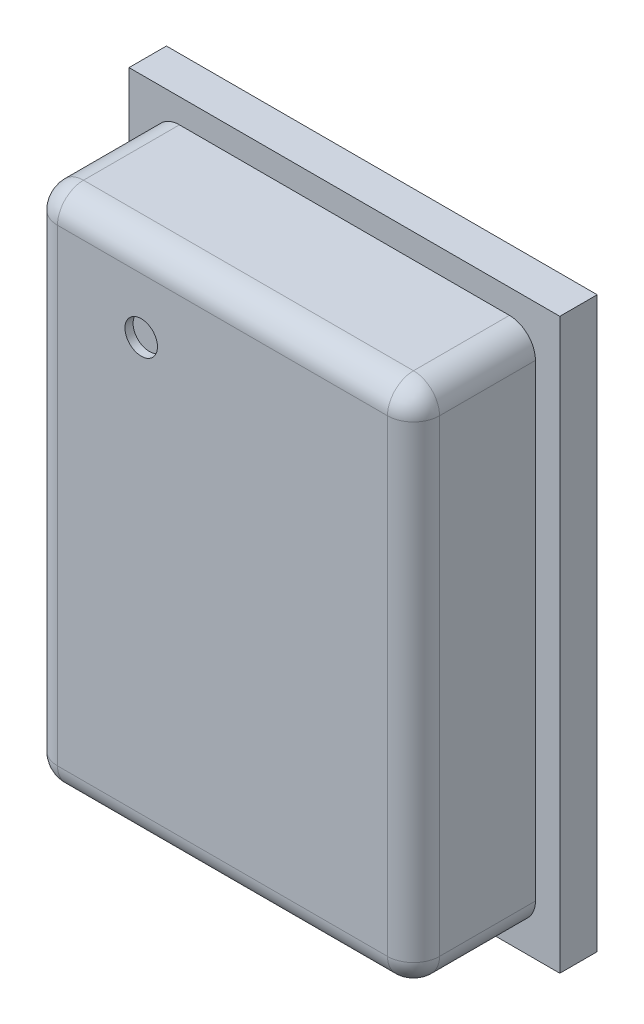
ISO-10303-21;
HEADER;
FILE_DESCRIPTION(('STEP AP214'),'2;1');
FILE_NAME('part.step','',(''),(''),'','','');
FILE_SCHEMA(('AUTOMOTIVE_DESIGN { 1 0 10303 214 1 1 1 1 }'));
ENDSEC;
DATA;
#1=APPLICATION_CONTEXT('core data for automotive mechanical design processes');
#2=APPLICATION_PROTOCOL_DEFINITION('international standard','automotive_design',2000,#1);
#3=PRODUCT_CONTEXT('',#1,'mechanical');
#4=PRODUCT('Part','Part','',(#3));
#5=PRODUCT_RELATED_PRODUCT_CATEGORY('part','',(#4));
#6=PRODUCT_DEFINITION_FORMATION('','',#4);
#7=PRODUCT_DEFINITION_CONTEXT('part definition',#1,'design');
#8=PRODUCT_DEFINITION('design','',#6,#7);
#9=PRODUCT_DEFINITION_SHAPE('','',#8);
#10=(LENGTH_UNIT() NAMED_UNIT(*) SI_UNIT(.MILLI.,.METRE.));
#11=(NAMED_UNIT(*) PLANE_ANGLE_UNIT() SI_UNIT($,.RADIAN.));
#12=(NAMED_UNIT(*) SI_UNIT($,.STERADIAN.) SOLID_ANGLE_UNIT());
#13=UNCERTAINTY_MEASURE_WITH_UNIT(LENGTH_MEASURE(1.E-05),#10,'distance_accuracy_value','');
#14=(GEOMETRIC_REPRESENTATION_CONTEXT(3) GLOBAL_UNCERTAINTY_ASSIGNED_CONTEXT((#13)) GLOBAL_UNIT_ASSIGNED_CONTEXT((#10,
#11,#12)) REPRESENTATION_CONTEXT('',''));
#15=CARTESIAN_POINT('',(0.,0.,0.));
#16=DIRECTION('',(0.,0.,1.));
#17=DIRECTION('',(1.,0.,0.));
#18=AXIS2_PLACEMENT_3D('',#15,#16,#17);
#19=CARTESIAN_POINT('',(0.,-0.71,0.23));
#20=DIRECTION('',(0.,0.,1.));
#21=DIRECTION('',(1.,0.,0.));
#22=AXIS2_PLACEMENT_3D('',#19,#20,#21);
#23=CYLINDRICAL_SURFACE('',#22,0.1625);
#24=CARTESIAN_POINT('',(0.,-0.71,0.));
#25=DIRECTION('',(0.,0.,1.));
#26=DIRECTION('',(1.,0.,0.));
#27=AXIS2_PLACEMENT_3D('',#24,#25,#26);
#28=CIRCLE('',#27,0.1625);
#29=CARTESIAN_POINT('',(0.1625,-0.71,0.));
#30=VERTEX_POINT('',#29);
#31=EDGE_CURVE('P0_E110',#30,#30,#28,.T.);
#32=ORIENTED_EDGE('',*,*,#31,.F.);
#33=EDGE_LOOP('',(#32));
#34=FACE_BOUND('',#33,.T.);
#35=CARTESIAN_POINT('',(0.,-0.71,0.23));
#36=DIRECTION('',(0.,0.,1.));
#37=DIRECTION('',(1.,0.,0.));
#38=AXIS2_PLACEMENT_3D('',#35,#36,#37);
#39=CIRCLE('',#38,0.1625);
#40=CARTESIAN_POINT('',(0.1625,-0.71,0.23));
#41=VERTEX_POINT('',#40);
#42=EDGE_CURVE('P0_E11',#41,#41,#39,.T.);
#43=ORIENTED_EDGE('',*,*,#42,.T.);
#44=EDGE_LOOP('',(#43));
#45=FACE_BOUND('',#44,.T.);
#46=ADVANCED_FACE('P0_F17',(#34,#45),#23,.F.);
#47=CARTESIAN_POINT('',(1.325,-1.75,0.));
#48=DIRECTION('',(0.,-1.,0.));
#49=DIRECTION('',(0.,0.,-1.));
#50=AXIS2_PLACEMENT_3D('',#47,#48,#49);
#51=PLANE('',#50);
#52=DIRECTION('',(0.,0.,1.));
#53=VECTOR('',#52,1.);
#54=CARTESIAN_POINT('',(1.325,-1.75,0.));
#55=LINE('',#54,#53);
#56=CARTESIAN_POINT('',(1.325,-1.75,0.));
#57=VERTEX_POINT('',#56);
#58=CARTESIAN_POINT('',(1.325,-1.75,0.23));
#59=VERTEX_POINT('',#58);
#60=EDGE_CURVE('P0_E117',#57,#59,#55,.T.);
#61=ORIENTED_EDGE('',*,*,#60,.T.);
#62=DIRECTION('',(-1.,0.,0.));
#63=VECTOR('',#62,1.);
#64=CARTESIAN_POINT('',(1.325,-1.75,0.23));
#65=LINE('',#64,#63);
#66=CARTESIAN_POINT('',(-1.325,-1.75,0.23));
#67=VERTEX_POINT('',#66);
#68=EDGE_CURVE('P0_E26',#59,#67,#65,.T.);
#69=ORIENTED_EDGE('',*,*,#68,.T.);
#70=DIRECTION('',(0.,0.,1.));
#71=VECTOR('',#70,1.);
#72=CARTESIAN_POINT('',(-1.325,-1.75,0.));
#73=LINE('',#72,#71);
#74=CARTESIAN_POINT('',(-1.325,-1.75,0.));
#75=VERTEX_POINT('',#74);
#76=EDGE_CURVE('P0_E94',#75,#67,#73,.T.);
#77=ORIENTED_EDGE('',*,*,#76,.F.);
#78=DIRECTION('',(-1.,0.,0.));
#79=VECTOR('',#78,1.);
#80=CARTESIAN_POINT('',(1.325,-1.75,0.));
#81=LINE('',#80,#79);
#82=EDGE_CURVE('P0_E38',#57,#75,#81,.T.);
#83=ORIENTED_EDGE('',*,*,#82,.F.);
#84=EDGE_LOOP('',(#61,#69,#77,#83));
#85=FACE_BOUND('',#84,.T.);
#86=ADVANCED_FACE('P0_F160',(#85),#51,.T.);
#87=CARTESIAN_POINT('',(0.,0.,0.23));
#88=DIRECTION('',(0.,0.,1.));
#89=DIRECTION('',(1.,0.,0.));
#90=AXIS2_PLACEMENT_3D('',#87,#88,#89);
#91=PLANE('',#90);
#92=ORIENTED_EDGE('',*,*,#42,.F.);
#93=EDGE_LOOP('',(#92));
#94=FACE_BOUND('',#93,.T.);
#95=DIRECTION('',(1.,0.,0.));
#96=VECTOR('',#95,1.);
#97=CARTESIAN_POINT('',(-1.325,1.75,0.23));
#98=LINE('',#97,#96);
#99=CARTESIAN_POINT('',(-1.325,1.75,0.23));
#100=VERTEX_POINT('',#99);
#101=CARTESIAN_POINT('',(1.325,1.75,0.23));
#102=VERTEX_POINT('',#101);
#103=EDGE_CURVE('P0_E99',#100,#102,#98,.T.);
#104=ORIENTED_EDGE('',*,*,#103,.F.);
#105=DIRECTION('',(0.,1.,0.));
#106=VECTOR('',#105,1.);
#107=CARTESIAN_POINT('',(-1.325,-1.75,0.23));
#108=LINE('',#107,#106);
#109=EDGE_CURVE('P0_E85',#67,#100,#108,.T.);
#110=ORIENTED_EDGE('',*,*,#109,.F.);
#111=ORIENTED_EDGE('',*,*,#68,.F.);
#112=DIRECTION('',(0.,-1.,0.));
#113=VECTOR('',#112,1.);
#114=CARTESIAN_POINT('',(1.325,1.75,0.23));
#115=LINE('',#114,#113);
#116=EDGE_CURVE('P0_E84',#102,#59,#115,.T.);
#117=ORIENTED_EDGE('',*,*,#116,.F.);
#118=EDGE_LOOP('',(#104,#110,#111,#117));
#119=FACE_BOUND('',#118,.T.);
#120=ADVANCED_FACE('P0_F155',(#94,#119),#91,.T.);
#121=CARTESIAN_POINT('',(0.,0.,0.));
#122=DIRECTION('',(0.,0.,1.));
#123=DIRECTION('',(1.,0.,0.));
#124=AXIS2_PLACEMENT_3D('',#121,#122,#123);
#125=PLANE('',#124);
#126=ORIENTED_EDGE('',*,*,#31,.T.);
#127=EDGE_LOOP('',(#126));
#128=FACE_BOUND('',#127,.T.);
#129=DIRECTION('',(0.,-1.,0.));
#130=VECTOR('',#129,1.);
#131=CARTESIAN_POINT('',(1.325,1.75,0.));
#132=LINE('',#131,#130);
#133=CARTESIAN_POINT('',(1.325,1.75,0.));
#134=VERTEX_POINT('',#133);
#135=EDGE_CURVE('P0_E62',#134,#57,#132,.T.);
#136=ORIENTED_EDGE('',*,*,#135,.T.);
#137=ORIENTED_EDGE('',*,*,#82,.T.);
#138=DIRECTION('',(0.,1.,0.));
#139=VECTOR('',#138,1.);
#140=CARTESIAN_POINT('',(-1.325,-1.75,0.));
#141=LINE('',#140,#139);
#142=CARTESIAN_POINT('',(-1.325,1.75,0.));
#143=VERTEX_POINT('',#142);
#144=EDGE_CURVE('P0_E75',#75,#143,#141,.T.);
#145=ORIENTED_EDGE('',*,*,#144,.T.);
#146=DIRECTION('',(1.,0.,0.));
#147=VECTOR('',#146,1.);
#148=CARTESIAN_POINT('',(-1.325,1.75,0.));
#149=LINE('',#148,#147);
#150=EDGE_CURVE('P0_E78',#143,#134,#149,.T.);
#151=ORIENTED_EDGE('',*,*,#150,.T.);
#152=EDGE_LOOP('',(#136,#137,#145,#151));
#153=FACE_BOUND('',#152,.T.);
#154=ADVANCED_FACE('P0_F77',(#128,#153),#125,.F.);
#155=CARTESIAN_POINT('',(1.325,1.75,0.));
#156=DIRECTION('',(1.,0.,0.));
#157=DIRECTION('',(0.,1.,0.));
#158=AXIS2_PLACEMENT_3D('',#155,#156,#157);
#159=PLANE('',#158);
#160=DIRECTION('',(0.,0.,1.));
#161=VECTOR('',#160,1.);
#162=CARTESIAN_POINT('',(1.325,1.75,0.));
#163=LINE('',#162,#161);
#164=EDGE_CURVE('P0_E92',#134,#102,#163,.T.);
#165=ORIENTED_EDGE('',*,*,#164,.T.);
#166=ORIENTED_EDGE('',*,*,#116,.T.);
#167=ORIENTED_EDGE('',*,*,#60,.F.);
#168=ORIENTED_EDGE('',*,*,#135,.F.);
#169=EDGE_LOOP('',(#165,#166,#167,#168));
#170=FACE_BOUND('',#169,.T.);
#171=ADVANCED_FACE('P0_F143',(#170),#159,.T.);
#172=CARTESIAN_POINT('',(-1.325,-1.75,0.));
#173=DIRECTION('',(-1.,0.,0.));
#174=DIRECTION('',(0.,0.,1.));
#175=AXIS2_PLACEMENT_3D('',#172,#173,#174);
#176=PLANE('',#175);
#177=ORIENTED_EDGE('',*,*,#76,.T.);
#178=ORIENTED_EDGE('',*,*,#109,.T.);
#179=DIRECTION('',(0.,0.,1.));
#180=VECTOR('',#179,1.);
#181=CARTESIAN_POINT('',(-1.325,1.75,0.));
#182=LINE('',#181,#180);
#183=EDGE_CURVE('P0_E91',#143,#100,#182,.T.);
#184=ORIENTED_EDGE('',*,*,#183,.F.);
#185=ORIENTED_EDGE('',*,*,#144,.F.);
#186=EDGE_LOOP('',(#177,#178,#184,#185));
#187=FACE_BOUND('',#186,.T.);
#188=ADVANCED_FACE('P0_F96',(#187),#176,.T.);
#189=CARTESIAN_POINT('',(-1.325,1.75,0.));
#190=DIRECTION('',(0.,1.,0.));
#191=DIRECTION('',(1.,0.,0.));
#192=AXIS2_PLACEMENT_3D('',#189,#190,#191);
#193=PLANE('',#192);
#194=ORIENTED_EDGE('',*,*,#183,.T.);
#195=ORIENTED_EDGE('',*,*,#103,.T.);
#196=ORIENTED_EDGE('',*,*,#164,.F.);
#197=ORIENTED_EDGE('',*,*,#150,.F.);
#198=EDGE_LOOP('',(#194,#195,#196,#197));
#199=FACE_BOUND('',#198,.T.);
#200=ADVANCED_FACE('P0_F89',(#199),#193,.T.);
#201=CLOSED_SHELL('',(#46,#86,#120,#154,#171,#188,#200));
#202=MANIFOLD_SOLID_BREP('P0_B1',#201);
#203=CARTESIAN_POINT('',(-0.5,1.1,0.93));
#204=DIRECTION('',(0.,0.,1.));
#205=DIRECTION('',(1.,0.,0.));
#206=AXIS2_PLACEMENT_3D('',#203,#204,#205);
#207=PLANE('',#206);
#208=CARTESIAN_POINT('',(-0.5,1.1,0.93));
#209=DIRECTION('',(0.,0.,1.));
#210=DIRECTION('',(1.,0.,0.));
#211=AXIS2_PLACEMENT_3D('',#208,#209,#210);
#212=CIRCLE('',#211,0.1);
#213=CARTESIAN_POINT('',(-0.4,1.1,0.93));
#214=VERTEX_POINT('',#213);
#215=EDGE_CURVE('P1_E11',#214,#214,#212,.T.);
#216=ORIENTED_EDGE('',*,*,#215,.T.);
#217=EDGE_LOOP('',(#216));
#218=FACE_BOUND('',#217,.T.);
#219=ADVANCED_FACE('P1_F17',(#218),#207,.T.);
#220=CARTESIAN_POINT('',(-0.5,1.1,0.98));
#221=DIRECTION('',(0.,0.,1.));
#222=DIRECTION('',(1.,0.,0.));
#223=AXIS2_PLACEMENT_3D('',#220,#221,#222);
#224=CYLINDRICAL_SURFACE('',#223,0.1);
#225=ORIENTED_EDGE('',*,*,#215,.F.);
#226=EDGE_LOOP('',(#225));
#227=FACE_BOUND('',#226,.T.);
#228=CARTESIAN_POINT('',(-0.5,1.1,0.98));
#229=DIRECTION('',(0.,0.,1.));
#230=DIRECTION('',(1.,0.,0.));
#231=AXIS2_PLACEMENT_3D('',#228,#229,#230);
#232=CIRCLE('',#231,0.1);
#233=CARTESIAN_POINT('',(-0.4,1.1,0.98));
#234=VERTEX_POINT('',#233);
#235=EDGE_CURVE('P1_E250',#234,#234,#232,.T.);
#236=ORIENTED_EDGE('',*,*,#235,.T.);
#237=EDGE_LOOP('',(#236));
#238=FACE_BOUND('',#237,.T.);
#239=ADVANCED_FACE('P1_F350',(#227,#238),#224,.F.);
#240=CARTESIAN_POINT('',(1.175,-1.44,0.82));
#241=DIRECTION('',(-1.,0.,0.));
#242=DIRECTION('',(0.,-1.,0.));
#243=AXIS2_PLACEMENT_3D('',#240,#241,#242);
#244=CYLINDRICAL_SURFACE('',#243,0.16);
#245=CARTESIAN_POINT('',(1.015,-1.44,0.82));
#246=DIRECTION('',(-1.,0.,0.));
#247=DIRECTION('',(0.,0.,1.));
#248=AXIS2_PLACEMENT_3D('',#245,#246,#247);
#249=CIRCLE('',#248,0.16);
#250=CARTESIAN_POINT('',(1.015,-1.6,0.82));
#251=VERTEX_POINT('',#250);
#252=CARTESIAN_POINT('',(1.015,-1.44,0.98));
#253=VERTEX_POINT('',#252);
#254=EDGE_CURVE('P1_E25',#251,#253,#249,.T.);
#255=ORIENTED_EDGE('',*,*,#254,.T.);
#256=DIRECTION('',(-1.,0.,0.));
#257=VECTOR('',#256,1.);
#258=CARTESIAN_POINT('',(1.175,-1.44,0.98));
#259=LINE('',#258,#257);
#260=CARTESIAN_POINT('',(-1.015,-1.44,0.98));
#261=VERTEX_POINT('',#260);
#262=EDGE_CURVE('P1_E243',#253,#261,#259,.T.);
#263=ORIENTED_EDGE('',*,*,#262,.T.);
#264=CARTESIAN_POINT('',(-1.015,-1.44,0.82));
#265=DIRECTION('',(-1.,0.,0.));
#266=DIRECTION('',(0.,0.,1.));
#267=AXIS2_PLACEMENT_3D('',#264,#265,#266);
#268=CIRCLE('',#267,0.16);
#269=CARTESIAN_POINT('',(-1.015,-1.6,0.82));
#270=VERTEX_POINT('',#269);
#271=EDGE_CURVE('P1_E46',#270,#261,#268,.T.);
#272=ORIENTED_EDGE('',*,*,#271,.F.);
#273=DIRECTION('',(-1.,0.,0.));
#274=VECTOR('',#273,1.);
#275=CARTESIAN_POINT('',(1.175,-1.6,0.82));
#276=LINE('',#275,#274);
#277=EDGE_CURVE('P1_E133',#251,#270,#276,.T.);
#278=ORIENTED_EDGE('',*,*,#277,.F.);
#279=EDGE_LOOP('',(#255,#263,#272,#278));
#280=FACE_BOUND('',#279,.T.);
#281=ADVANCED_FACE('P1_F344',(#280),#244,.T.);
#282=CARTESIAN_POINT('',(1.015,-1.44,0.82));
#283=DIRECTION('',(0.,1.,0.));
#284=DIRECTION('',(0.,0.,1.));
#285=AXIS2_PLACEMENT_3D('',#282,#283,#284);
#286=SPHERICAL_SURFACE('',#285,0.16);
#287=ORIENTED_EDGE('',*,*,#254,.F.);
#288=CARTESIAN_POINT('',(1.015,-1.44,0.82));
#289=DIRECTION('',(0.,0.,1.));
#290=DIRECTION('',(1.,0.,0.));
#291=AXIS2_PLACEMENT_3D('',#288,#289,#290);
#292=CIRCLE('',#291,0.16);
#293=CARTESIAN_POINT('',(1.175,-1.44,0.82));
#294=VERTEX_POINT('',#293);
#295=EDGE_CURVE('P1_E129',#251,#294,#292,.T.);
#296=ORIENTED_EDGE('',*,*,#295,.T.);
#297=CARTESIAN_POINT('',(1.015,-1.44,0.82));
#298=DIRECTION('',(0.,1.,0.));
#299=DIRECTION('',(0.,0.,1.));
#300=AXIS2_PLACEMENT_3D('',#297,#298,#299);
#301=CIRCLE('',#300,0.16);
#302=EDGE_CURVE('P1_E257',#253,#294,#301,.T.);
#303=ORIENTED_EDGE('',*,*,#302,.F.);
#304=EDGE_LOOP('',(#287,#296,#303));
#305=FACE_BOUND('',#304,.T.);
#306=ADVANCED_FACE('P1_F349',(#305),#286,.T.);
#307=CARTESIAN_POINT('',(-1.015,-1.44,0.82));
#308=DIRECTION('',(0.,1.,0.));
#309=DIRECTION('',(-1.,0.,0.));
#310=AXIS2_PLACEMENT_3D('',#307,#308,#309);
#311=SPHERICAL_SURFACE('',#310,0.16);
#312=CARTESIAN_POINT('',(-1.015,-1.44,0.82));
#313=DIRECTION('',(0.,0.,-1.));
#314=DIRECTION('',(-1.,0.,0.));
#315=AXIS2_PLACEMENT_3D('',#312,#313,#314);
#316=CIRCLE('',#315,0.16);
#317=CARTESIAN_POINT('',(-1.175,-1.44,0.82));
#318=VERTEX_POINT('',#317);
#319=EDGE_CURVE('P1_E226',#270,#318,#316,.T.);
#320=ORIENTED_EDGE('',*,*,#319,.F.);
#321=ORIENTED_EDGE('',*,*,#271,.T.);
#322=CARTESIAN_POINT('',(-1.015,-1.44,0.82));
#323=DIRECTION('',(0.,1.,0.));
#324=DIRECTION('',(-1.,0.,0.));
#325=AXIS2_PLACEMENT_3D('',#322,#323,#324);
#326=CIRCLE('',#325,0.16);
#327=EDGE_CURVE('P1_E254',#318,#261,#326,.T.);
#328=ORIENTED_EDGE('',*,*,#327,.F.);
#329=EDGE_LOOP('',(#320,#321,#328));
#330=FACE_BOUND('',#329,.T.);
#331=ADVANCED_FACE('P1_F406',(#330),#311,.T.);
#332=CARTESIAN_POINT('',(1.015,1.6,0.82));
#333=DIRECTION('',(0.,-1.,0.));
#334=DIRECTION('',(1.,0.,0.));
#335=AXIS2_PLACEMENT_3D('',#332,#333,#334);
#336=CYLINDRICAL_SURFACE('',#335,0.16);
#337=DIRECTION('',(0.,-1.,0.));
#338=VECTOR('',#337,1.);
#339=CARTESIAN_POINT('',(1.175,1.6,0.82));
#340=LINE('',#339,#338);
#341=CARTESIAN_POINT('',(1.175,1.44,0.82));
#342=VERTEX_POINT('',#341);
#343=EDGE_CURVE('P1_E162',#342,#294,#340,.T.);
#344=ORIENTED_EDGE('',*,*,#343,.F.);
#345=CARTESIAN_POINT('',(1.015,1.44,0.82));
#346=DIRECTION('',(0.,1.,0.));
#347=DIRECTION('',(0.,0.,1.));
#348=AXIS2_PLACEMENT_3D('',#345,#346,#347);
#349=CIRCLE('',#348,0.16);
#350=CARTESIAN_POINT('',(1.015,1.44,0.98));
#351=VERTEX_POINT('',#350);
#352=EDGE_CURVE('P1_E237',#351,#342,#349,.T.);
#353=ORIENTED_EDGE('',*,*,#352,.F.);
#354=DIRECTION('',(0.,-1.,0.));
#355=VECTOR('',#354,1.);
#356=CARTESIAN_POINT('',(1.015,1.6,0.98));
#357=LINE('',#356,#355);
#358=EDGE_CURVE('P1_E246',#351,#253,#357,.T.);
#359=ORIENTED_EDGE('',*,*,#358,.T.);
#360=ORIENTED_EDGE('',*,*,#302,.T.);
#361=EDGE_LOOP('',(#344,#353,#359,#360));
#362=FACE_BOUND('',#361,.T.);
#363=ADVANCED_FACE('P1_F359',(#362),#336,.T.);
#364=CARTESIAN_POINT('',(-1.015,-1.6,0.82));
#365=DIRECTION('',(0.,1.,0.));
#366=DIRECTION('',(-1.,0.,0.));
#367=AXIS2_PLACEMENT_3D('',#364,#365,#366);
#368=CYLINDRICAL_SURFACE('',#367,0.16);
#369=DIRECTION('',(0.,1.,0.));
#370=VECTOR('',#369,1.);
#371=CARTESIAN_POINT('',(-1.175,-1.6,0.82));
#372=LINE('',#371,#370);
#373=CARTESIAN_POINT('',(-1.175,1.44,0.82));
#374=VERTEX_POINT('',#373);
#375=EDGE_CURVE('P1_E166',#318,#374,#372,.T.);
#376=ORIENTED_EDGE('',*,*,#375,.F.);
#377=ORIENTED_EDGE('',*,*,#327,.T.);
#378=DIRECTION('',(0.,1.,0.));
#379=VECTOR('',#378,1.);
#380=CARTESIAN_POINT('',(-1.015,-1.6,0.98));
#381=LINE('',#380,#379);
#382=CARTESIAN_POINT('',(-1.015,1.44,0.98));
#383=VERTEX_POINT('',#382);
#384=EDGE_CURVE('P1_E240',#261,#383,#381,.T.);
#385=ORIENTED_EDGE('',*,*,#384,.T.);
#386=CARTESIAN_POINT('',(-1.015,1.44,0.82));
#387=DIRECTION('',(0.,-1.,0.));
#388=DIRECTION('',(-1.,0.,0.));
#389=AXIS2_PLACEMENT_3D('',#386,#387,#388);
#390=CIRCLE('',#389,0.16);
#391=EDGE_CURVE('P1_E234',#383,#374,#390,.T.);
#392=ORIENTED_EDGE('',*,*,#391,.T.);
#393=EDGE_LOOP('',(#376,#377,#385,#392));
#394=FACE_BOUND('',#393,.T.);
#395=ADVANCED_FACE('P1_F304',(#394),#368,.T.);
#396=CARTESIAN_POINT('',(0.,0.,0.98));
#397=DIRECTION('',(0.,0.,1.));
#398=DIRECTION('',(1.,0.,0.));
#399=AXIS2_PLACEMENT_3D('',#396,#397,#398);
#400=PLANE('',#399);
#401=ORIENTED_EDGE('',*,*,#235,.F.);
#402=EDGE_LOOP('',(#401));
#403=FACE_BOUND('',#402,.T.);
#404=ORIENTED_EDGE('',*,*,#384,.F.);
#405=ORIENTED_EDGE('',*,*,#262,.F.);
#406=ORIENTED_EDGE('',*,*,#358,.F.);
#407=DIRECTION('',(1.,0.,0.));
#408=VECTOR('',#407,1.);
#409=CARTESIAN_POINT('',(-1.175,1.44,0.98));
#410=LINE('',#409,#408);
#411=EDGE_CURVE('P1_E212',#383,#351,#410,.T.);
#412=ORIENTED_EDGE('',*,*,#411,.F.);
#413=EDGE_LOOP('',(#404,#405,#406,#412));
#414=FACE_BOUND('',#413,.T.);
#415=ADVANCED_FACE('P1_F299',(#403,#414),#400,.T.);
#416=CARTESIAN_POINT('',(1.015,1.44,0.82));
#417=DIRECTION('',(0.,-1.,0.));
#418=DIRECTION('',(0.,0.,1.));
#419=AXIS2_PLACEMENT_3D('',#416,#417,#418);
#420=SPHERICAL_SURFACE('',#419,0.16);
#421=ORIENTED_EDGE('',*,*,#352,.T.);
#422=CARTESIAN_POINT('',(1.015,1.44,0.82));
#423=DIRECTION('',(0.,0.,-1.));
#424=DIRECTION('',(1.,0.,0.));
#425=AXIS2_PLACEMENT_3D('',#422,#423,#424);
#426=CIRCLE('',#425,0.16);
#427=CARTESIAN_POINT('',(1.015,1.6,0.82));
#428=VERTEX_POINT('',#427);
#429=EDGE_CURVE('P1_E180',#428,#342,#426,.T.);
#430=ORIENTED_EDGE('',*,*,#429,.F.);
#431=CARTESIAN_POINT('',(1.015,1.44,0.82));
#432=DIRECTION('',(1.,0.,0.));
#433=DIRECTION('',(0.,0.,1.));
#434=AXIS2_PLACEMENT_3D('',#431,#432,#433);
#435=CIRCLE('',#434,0.16);
#436=EDGE_CURVE('P1_E209',#428,#351,#435,.T.);
#437=ORIENTED_EDGE('',*,*,#436,.T.);
#438=EDGE_LOOP('',(#421,#430,#437));
#439=FACE_BOUND('',#438,.T.);
#440=ADVANCED_FACE('P1_F284',(#439),#420,.T.);
#441=CARTESIAN_POINT('',(-1.015,1.44,0.82));
#442=DIRECTION('',(0.,0.,-1.));
#443=DIRECTION('',(-1.,0.,0.));
#444=AXIS2_PLACEMENT_3D('',#441,#442,#443);
#445=SPHERICAL_SURFACE('',#444,0.16);
#446=ORIENTED_EDGE('',*,*,#391,.F.);
#447=CARTESIAN_POINT('',(-1.015,1.44,0.82));
#448=DIRECTION('',(-1.,0.,0.));
#449=DIRECTION('',(0.,1.,0.));
#450=AXIS2_PLACEMENT_3D('',#447,#448,#449);
#451=CIRCLE('',#450,0.16);
#452=CARTESIAN_POINT('',(-1.015,1.6,0.82));
#453=VERTEX_POINT('',#452);
#454=EDGE_CURVE('P1_E190',#383,#453,#451,.T.);
#455=ORIENTED_EDGE('',*,*,#454,.T.);
#456=CARTESIAN_POINT('',(-1.015,1.44,0.82));
#457=DIRECTION('',(0.,0.,-1.));
#458=DIRECTION('',(-1.,0.,0.));
#459=AXIS2_PLACEMENT_3D('',#456,#457,#458);
#460=CIRCLE('',#459,0.16);
#461=EDGE_CURVE('P1_E185',#374,#453,#460,.T.);
#462=ORIENTED_EDGE('',*,*,#461,.F.);
#463=EDGE_LOOP('',(#446,#455,#462));
#464=FACE_BOUND('',#463,.T.);
#465=ADVANCED_FACE('P1_F279',(#464),#445,.T.);
#466=CARTESIAN_POINT('',(1.175,-1.6,0.23));
#467=DIRECTION('',(0.,-1.,0.));
#468=DIRECTION('',(0.,0.,-1.));
#469=AXIS2_PLACEMENT_3D('',#466,#467,#468);
#470=PLANE('',#469);
#471=DIRECTION('',(-1.,0.,0.));
#472=VECTOR('',#471,1.);
#473=CARTESIAN_POINT('',(1.175,-1.6,0.23));
#474=LINE('',#473,#472);
#475=CARTESIAN_POINT('',(1.015,-1.6,0.23));
#476=VERTEX_POINT('',#475);
#477=CARTESIAN_POINT('',(-1.015,-1.6,0.23));
#478=VERTEX_POINT('',#477);
#479=EDGE_CURVE('P1_E136',#476,#478,#474,.T.);
#480=ORIENTED_EDGE('',*,*,#479,.F.);
#481=DIRECTION('',(0.,0.,1.));
#482=VECTOR('',#481,1.);
#483=CARTESIAN_POINT('',(1.015,-1.6,0.23));
#484=LINE('',#483,#482);
#485=EDGE_CURVE('P1_E121',#476,#251,#484,.T.);
#486=ORIENTED_EDGE('',*,*,#485,.T.);
#487=ORIENTED_EDGE('',*,*,#277,.T.);
#488=DIRECTION('',(0.,0.,1.));
#489=VECTOR('',#488,1.);
#490=CARTESIAN_POINT('',(-1.015,-1.6,0.23));
#491=LINE('',#490,#489);
#492=EDGE_CURVE('P1_E139',#478,#270,#491,.T.);
#493=ORIENTED_EDGE('',*,*,#492,.F.);
#494=EDGE_LOOP('',(#480,#486,#487,#493));
#495=FACE_BOUND('',#494,.T.);
#496=ADVANCED_FACE('P1_F137',(#495),#470,.T.);
#497=CARTESIAN_POINT('',(1.015,-1.44,0.23));
#498=DIRECTION('',(0.,0.,1.));
#499=DIRECTION('',(1.,0.,0.));
#500=AXIS2_PLACEMENT_3D('',#497,#498,#499);
#501=CYLINDRICAL_SURFACE('',#500,0.16);
#502=DIRECTION('',(0.,0.,1.));
#503=VECTOR('',#502,1.);
#504=CARTESIAN_POINT('',(1.175,-1.44,0.23));
#505=LINE('',#504,#503);
#506=CARTESIAN_POINT('',(1.175,-1.44,0.23));
#507=VERTEX_POINT('',#506);
#508=EDGE_CURVE('P1_E165',#507,#294,#505,.T.);
#509=ORIENTED_EDGE('',*,*,#508,.T.);
#510=ORIENTED_EDGE('',*,*,#295,.F.);
#511=ORIENTED_EDGE('',*,*,#485,.F.);
#512=CARTESIAN_POINT('',(1.015,-1.44,0.23));
#513=DIRECTION('',(0.,0.,-1.));
#514=DIRECTION('',(0.,-1.,0.));
#515=AXIS2_PLACEMENT_3D('',#512,#513,#514);
#516=CIRCLE('',#515,0.16);
#517=EDGE_CURVE('P1_E126',#507,#476,#516,.T.);
#518=ORIENTED_EDGE('',*,*,#517,.F.);
#519=EDGE_LOOP('',(#509,#510,#511,#518));
#520=FACE_BOUND('',#519,.T.);
#521=ADVANCED_FACE('P1_F124',(#520),#501,.T.);
#522=CARTESIAN_POINT('',(-1.015,-1.44,0.23));
#523=DIRECTION('',(0.,0.,1.));
#524=DIRECTION('',(0.,-1.,0.));
#525=AXIS2_PLACEMENT_3D('',#522,#523,#524);
#526=CYLINDRICAL_SURFACE('',#525,0.16);
#527=ORIENTED_EDGE('',*,*,#492,.T.);
#528=ORIENTED_EDGE('',*,*,#319,.T.);
#529=DIRECTION('',(0.,0.,1.));
#530=VECTOR('',#529,1.);
#531=CARTESIAN_POINT('',(-1.175,-1.44,0.23));
#532=LINE('',#531,#530);
#533=CARTESIAN_POINT('',(-1.175,-1.44,0.23));
#534=VERTEX_POINT('',#533);
#535=EDGE_CURVE('P1_E205',#534,#318,#532,.T.);
#536=ORIENTED_EDGE('',*,*,#535,.F.);
#537=CARTESIAN_POINT('',(-1.015,-1.44,0.23));
#538=DIRECTION('',(0.,0.,-1.));
#539=DIRECTION('',(0.,-1.,0.));
#540=AXIS2_PLACEMENT_3D('',#537,#538,#539);
#541=CIRCLE('',#540,0.16);
#542=EDGE_CURVE('P1_E144',#478,#534,#541,.T.);
#543=ORIENTED_EDGE('',*,*,#542,.F.);
#544=EDGE_LOOP('',(#527,#528,#536,#543));
#545=FACE_BOUND('',#544,.T.);
#546=ADVANCED_FACE('P1_F384',(#545),#526,.T.);
#547=CARTESIAN_POINT('',(1.175,1.6,0.23));
#548=DIRECTION('',(1.,0.,0.));
#549=DIRECTION('',(0.,1.,0.));
#550=AXIS2_PLACEMENT_3D('',#547,#548,#549);
#551=PLANE('',#550);
#552=DIRECTION('',(0.,-1.,0.));
#553=VECTOR('',#552,1.);
#554=CARTESIAN_POINT('',(1.175,1.6,0.23));
#555=LINE('',#554,#553);
#556=CARTESIAN_POINT('',(1.175,1.44,0.23));
#557=VERTEX_POINT('',#556);
#558=EDGE_CURVE('P1_E149',#557,#507,#555,.T.);
#559=ORIENTED_EDGE('',*,*,#558,.F.);
#560=DIRECTION('',(0.,0.,1.));
#561=VECTOR('',#560,1.);
#562=CARTESIAN_POINT('',(1.175,1.44,0.23));
#563=LINE('',#562,#561);
#564=EDGE_CURVE('P1_E184',#557,#342,#563,.T.);
#565=ORIENTED_EDGE('',*,*,#564,.T.);
#566=ORIENTED_EDGE('',*,*,#343,.T.);
#567=ORIENTED_EDGE('',*,*,#508,.F.);
#568=EDGE_LOOP('',(#559,#565,#566,#567));
#569=FACE_BOUND('',#568,.T.);
#570=ADVANCED_FACE('P1_F368',(#569),#551,.T.);
#571=CARTESIAN_POINT('',(-1.175,-1.6,0.23));
#572=DIRECTION('',(-1.,0.,0.));
#573=DIRECTION('',(0.,0.,1.));
#574=AXIS2_PLACEMENT_3D('',#571,#572,#573);
#575=PLANE('',#574);
#576=DIRECTION('',(0.,1.,0.));
#577=VECTOR('',#576,1.);
#578=CARTESIAN_POINT('',(-1.175,-1.6,0.23));
#579=LINE('',#578,#577);
#580=CARTESIAN_POINT('',(-1.175,1.44,0.23));
#581=VERTEX_POINT('',#580);
#582=EDGE_CURVE('P1_E194',#534,#581,#579,.T.);
#583=ORIENTED_EDGE('',*,*,#582,.F.);
#584=ORIENTED_EDGE('',*,*,#535,.T.);
#585=ORIENTED_EDGE('',*,*,#375,.T.);
#586=DIRECTION('',(0.,0.,1.));
#587=VECTOR('',#586,1.);
#588=CARTESIAN_POINT('',(-1.175,1.44,0.23));
#589=LINE('',#588,#587);
#590=EDGE_CURVE('P1_E198',#581,#374,#589,.T.);
#591=ORIENTED_EDGE('',*,*,#590,.F.);
#592=EDGE_LOOP('',(#583,#584,#585,#591));
#593=FACE_BOUND('',#592,.T.);
#594=ADVANCED_FACE('P1_F338',(#593),#575,.T.);
#595=CARTESIAN_POINT('',(-1.175,1.44,0.82));
#596=DIRECTION('',(1.,0.,0.));
#597=DIRECTION('',(0.,1.,0.));
#598=AXIS2_PLACEMENT_3D('',#595,#596,#597);
#599=CYLINDRICAL_SURFACE('',#598,0.16);
#600=ORIENTED_EDGE('',*,*,#454,.F.);
#601=ORIENTED_EDGE('',*,*,#411,.T.);
#602=ORIENTED_EDGE('',*,*,#436,.F.);
#603=DIRECTION('',(1.,0.,0.));
#604=VECTOR('',#603,1.);
#605=CARTESIAN_POINT('',(-1.175,1.6,0.82));
#606=LINE('',#605,#604);
#607=EDGE_CURVE('P1_E171',#453,#428,#606,.T.);
#608=ORIENTED_EDGE('',*,*,#607,.F.);
#609=EDGE_LOOP('',(#600,#601,#602,#608));
#610=FACE_BOUND('',#609,.T.);
#611=ADVANCED_FACE('P1_F329',(#610),#599,.T.);
#612=CARTESIAN_POINT('',(1.015,1.44,0.23));
#613=DIRECTION('',(0.,0.,1.));
#614=DIRECTION('',(0.,1.,0.));
#615=AXIS2_PLACEMENT_3D('',#612,#613,#614);
#616=CYLINDRICAL_SURFACE('',#615,0.16);
#617=DIRECTION('',(0.,0.,1.));
#618=VECTOR('',#617,1.);
#619=CARTESIAN_POINT('',(1.015,1.6,0.23));
#620=LINE('',#619,#618);
#621=CARTESIAN_POINT('',(1.015,1.6,0.23));
#622=VERTEX_POINT('',#621);
#623=EDGE_CURVE('P1_E176',#622,#428,#620,.T.);
#624=ORIENTED_EDGE('',*,*,#623,.T.);
#625=ORIENTED_EDGE('',*,*,#429,.T.);
#626=ORIENTED_EDGE('',*,*,#564,.F.);
#627=CARTESIAN_POINT('',(1.015,1.44,0.23));
#628=DIRECTION('',(0.,0.,-1.));
#629=DIRECTION('',(0.,-1.,0.));
#630=AXIS2_PLACEMENT_3D('',#627,#628,#629);
#631=CIRCLE('',#630,0.16);
#632=EDGE_CURVE('P1_E156',#622,#557,#631,.T.);
#633=ORIENTED_EDGE('',*,*,#632,.F.);
#634=EDGE_LOOP('',(#624,#625,#626,#633));
#635=FACE_BOUND('',#634,.T.);
#636=ADVANCED_FACE('P1_F320',(#635),#616,.T.);
#637=CARTESIAN_POINT('',(-1.015,1.44,0.23));
#638=DIRECTION('',(0.,0.,1.));
#639=DIRECTION('',(0.,1.,0.));
#640=AXIS2_PLACEMENT_3D('',#637,#638,#639);
#641=CYLINDRICAL_SURFACE('',#640,0.16);
#642=CARTESIAN_POINT('',(-1.015,1.44,0.23));
#643=DIRECTION('',(0.,0.,1.));
#644=DIRECTION('',(0.,-1.,0.));
#645=AXIS2_PLACEMENT_3D('',#642,#643,#644);
#646=CIRCLE('',#645,0.16);
#647=CARTESIAN_POINT('',(-1.015,1.6,0.23));
#648=VERTEX_POINT('',#647);
#649=EDGE_CURVE('P1_E160',#648,#581,#646,.T.);
#650=ORIENTED_EDGE('',*,*,#649,.T.);
#651=ORIENTED_EDGE('',*,*,#590,.T.);
#652=ORIENTED_EDGE('',*,*,#461,.T.);
#653=DIRECTION('',(0.,0.,1.));
#654=VECTOR('',#653,1.);
#655=CARTESIAN_POINT('',(-1.015,1.6,0.23));
#656=LINE('',#655,#654);
#657=EDGE_CURVE('P1_E167',#648,#453,#656,.T.);
#658=ORIENTED_EDGE('',*,*,#657,.F.);
#659=EDGE_LOOP('',(#650,#651,#652,#658));
#660=FACE_BOUND('',#659,.T.);
#661=ADVANCED_FACE('P1_F294',(#660),#641,.T.);
#662=CARTESIAN_POINT('',(0.,0.,0.23));
#663=DIRECTION('',(0.,0.,1.));
#664=DIRECTION('',(1.,0.,0.));
#665=AXIS2_PLACEMENT_3D('',#662,#663,#664);
#666=PLANE('',#665);
#667=ORIENTED_EDGE('',*,*,#632,.T.);
#668=ORIENTED_EDGE('',*,*,#558,.T.);
#669=ORIENTED_EDGE('',*,*,#517,.T.);
#670=ORIENTED_EDGE('',*,*,#479,.T.);
#671=ORIENTED_EDGE('',*,*,#542,.T.);
#672=ORIENTED_EDGE('',*,*,#582,.T.);
#673=ORIENTED_EDGE('',*,*,#649,.F.);
#674=DIRECTION('',(1.,0.,0.));
#675=VECTOR('',#674,1.);
#676=CARTESIAN_POINT('',(-1.175,1.6,0.23));
#677=LINE('',#676,#675);
#678=EDGE_CURVE('P1_E172',#648,#622,#677,.T.);
#679=ORIENTED_EDGE('',*,*,#678,.T.);
#680=EDGE_LOOP('',(#667,#668,#669,#670,#671,#672,#673,#679));
#681=FACE_BOUND('',#680,.T.);
#682=ADVANCED_FACE('P1_F147',(#681),#666,.F.);
#683=CARTESIAN_POINT('',(-1.175,1.6,0.23));
#684=DIRECTION('',(0.,1.,0.));
#685=DIRECTION('',(1.,0.,0.));
#686=AXIS2_PLACEMENT_3D('',#683,#684,#685);
#687=PLANE('',#686);
#688=ORIENTED_EDGE('',*,*,#678,.F.);
#689=ORIENTED_EDGE('',*,*,#657,.T.);
#690=ORIENTED_EDGE('',*,*,#607,.T.);
#691=ORIENTED_EDGE('',*,*,#623,.F.);
#692=EDGE_LOOP('',(#688,#689,#690,#691));
#693=FACE_BOUND('',#692,.T.);
#694=ADVANCED_FACE('P1_F268',(#693),#687,.T.);
#695=CLOSED_SHELL('',(#219,#239,#281,#306,#331,#363,#395,#415,#440,#465,#496,#521,#546,#570,
#594,#611,#636,#661,#682,#694));
#696=MANIFOLD_SOLID_BREP('P1_B1',#695);
#697=ADVANCED_BREP_SHAPE_REPRESENTATION('',(#18,#202,#696),#14);
#698=SHAPE_DEFINITION_REPRESENTATION(#9,#697);
ENDSEC;
END-ISO-10303-21;
